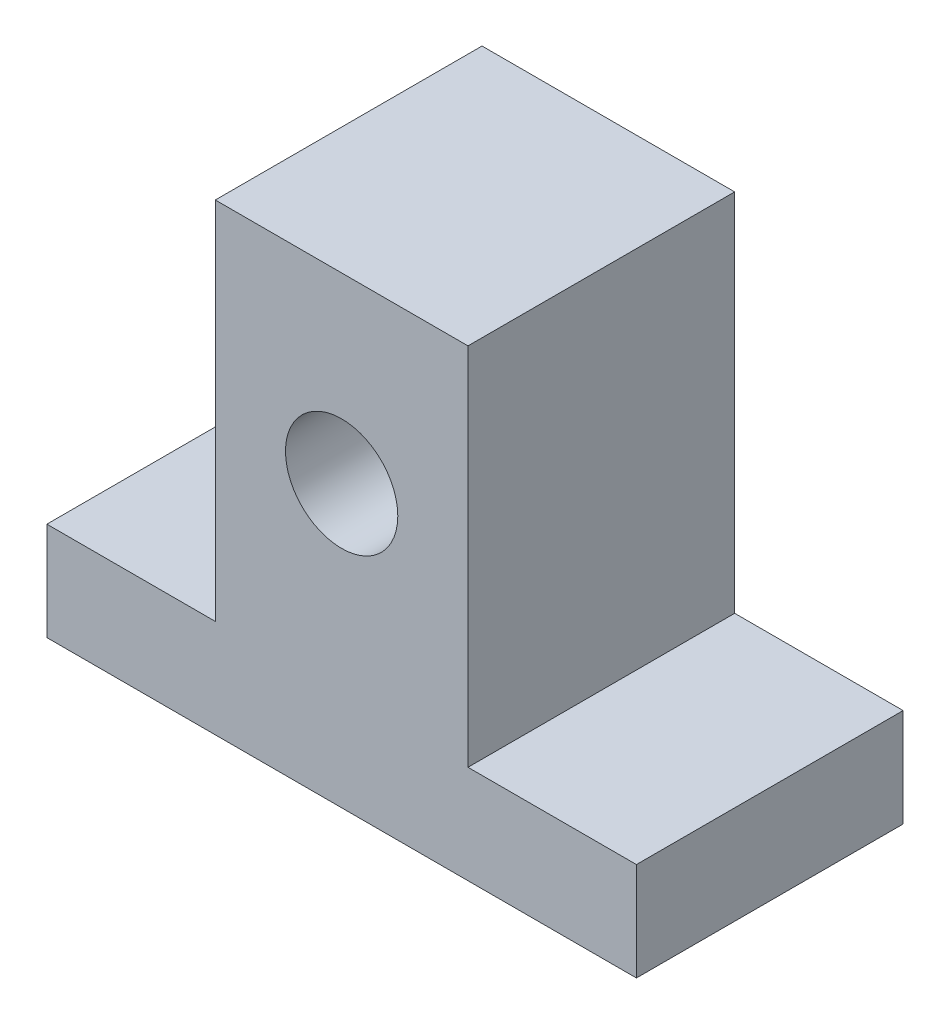
ISO-10303-21;
HEADER;
FILE_DESCRIPTION(('STEP AP214'),'2;1');
FILE_NAME('part.step','',(''),(''),'','','');
FILE_SCHEMA(('AUTOMOTIVE_DESIGN { 1 0 10303 214 1 1 1 1 }'));
ENDSEC;
DATA;
#1=APPLICATION_CONTEXT('core data for automotive mechanical design processes');
#2=APPLICATION_PROTOCOL_DEFINITION('international standard','automotive_design',2000,#1);
#3=PRODUCT_CONTEXT('',#1,'mechanical');
#4=PRODUCT('Part','Part','',(#3));
#5=PRODUCT_RELATED_PRODUCT_CATEGORY('part','',(#4));
#6=PRODUCT_DEFINITION_FORMATION('','',#4);
#7=PRODUCT_DEFINITION_CONTEXT('part definition',#1,'design');
#8=PRODUCT_DEFINITION('design','',#6,#7);
#9=PRODUCT_DEFINITION_SHAPE('','',#8);
#10=(LENGTH_UNIT() NAMED_UNIT(*) SI_UNIT(.MILLI.,.METRE.));
#11=(NAMED_UNIT(*) PLANE_ANGLE_UNIT() SI_UNIT($,.RADIAN.));
#12=(NAMED_UNIT(*) SI_UNIT($,.STERADIAN.) SOLID_ANGLE_UNIT());
#13=UNCERTAINTY_MEASURE_WITH_UNIT(LENGTH_MEASURE(1.E-05),#10,'distance_accuracy_value','');
#14=(GEOMETRIC_REPRESENTATION_CONTEXT(3) GLOBAL_UNCERTAINTY_ASSIGNED_CONTEXT((#13)) GLOBAL_UNIT_ASSIGNED_CONTEXT((#10,
#11,#12)) REPRESENTATION_CONTEXT('',''));
#15=CARTESIAN_POINT('',(0.,0.,0.));
#16=DIRECTION('',(0.,0.,1.));
#17=DIRECTION('',(1.,0.,0.));
#18=AXIS2_PLACEMENT_3D('',#15,#16,#17);
#19=CARTESIAN_POINT('',(-21.,0.,19.));
#20=DIRECTION('',(1.,0.,0.));
#21=DIRECTION('',(0.,0.,-1.));
#22=AXIS2_PLACEMENT_3D('',#19,#20,#21);
#23=PLANE('',#22);
#24=DIRECTION('',(0.,-1.,0.));
#25=VECTOR('',#24,1.);
#26=CARTESIAN_POINT('',(-21.,0.,0.));
#27=LINE('',#26,#25);
#28=CARTESIAN_POINT('',(-21.,7.,0.));
#29=VERTEX_POINT('',#28);
#30=CARTESIAN_POINT('',(-21.,0.,0.));
#31=VERTEX_POINT('',#30);
#32=EDGE_CURVE('E133',#29,#31,#27,.T.);
#33=ORIENTED_EDGE('',*,*,#32,.T.);
#34=DIRECTION('',(0.,0.,-1.));
#35=VECTOR('',#34,1.);
#36=CARTESIAN_POINT('',(-21.,0.,19.));
#37=LINE('',#36,#35);
#38=CARTESIAN_POINT('',(-21.,0.,19.));
#39=VERTEX_POINT('',#38);
#40=EDGE_CURVE('E11',#39,#31,#37,.T.);
#41=ORIENTED_EDGE('',*,*,#40,.F.);
#42=DIRECTION('',(0.,-1.,0.));
#43=VECTOR('',#42,1.);
#44=CARTESIAN_POINT('',(-21.,0.,19.));
#45=LINE('',#44,#43);
#46=CARTESIAN_POINT('',(-21.,7.,19.));
#47=VERTEX_POINT('',#46);
#48=EDGE_CURVE('E179',#47,#39,#45,.T.);
#49=ORIENTED_EDGE('',*,*,#48,.F.);
#50=DIRECTION('',(0.,0.,-1.));
#51=VECTOR('',#50,1.);
#52=CARTESIAN_POINT('',(-21.,7.,19.));
#53=LINE('',#52,#51);
#54=EDGE_CURVE('E126',#47,#29,#53,.T.);
#55=ORIENTED_EDGE('',*,*,#54,.T.);
#56=EDGE_LOOP('',(#33,#41,#49,#55));
#57=FACE_BOUND('',#56,.T.);
#58=ADVANCED_FACE('F33',(#57),#23,.F.);
#59=CARTESIAN_POINT('',(0.,0.,19.));
#60=DIRECTION('',(0.,1.,0.));
#61=DIRECTION('',(0.,0.,1.));
#62=AXIS2_PLACEMENT_3D('',#59,#60,#61);
#63=PLANE('',#62);
#64=DIRECTION('',(1.,0.,0.));
#65=VECTOR('',#64,1.);
#66=CARTESIAN_POINT('',(0.,0.,0.));
#67=LINE('',#66,#65);
#68=CARTESIAN_POINT('',(21.,0.,0.));
#69=VERTEX_POINT('',#68);
#70=EDGE_CURVE('E136',#31,#69,#67,.T.);
#71=ORIENTED_EDGE('',*,*,#70,.T.);
#72=DIRECTION('',(0.,0.,-1.));
#73=VECTOR('',#72,1.);
#74=CARTESIAN_POINT('',(21.,0.,19.));
#75=LINE('',#74,#73);
#76=CARTESIAN_POINT('',(21.,0.,19.));
#77=VERTEX_POINT('',#76);
#78=EDGE_CURVE('E42',#77,#69,#75,.T.);
#79=ORIENTED_EDGE('',*,*,#78,.F.);
#80=DIRECTION('',(1.,0.,0.));
#81=VECTOR('',#80,1.);
#82=CARTESIAN_POINT('',(0.,0.,19.));
#83=LINE('',#82,#81);
#84=EDGE_CURVE('E93',#39,#77,#83,.T.);
#85=ORIENTED_EDGE('',*,*,#84,.F.);
#86=ORIENTED_EDGE('',*,*,#40,.T.);
#87=EDGE_LOOP('',(#71,#79,#85,#86));
#88=FACE_BOUND('',#87,.T.);
#89=ADVANCED_FACE('F197',(#88),#63,.F.);
#90=CARTESIAN_POINT('',(21.,0.,19.));
#91=DIRECTION('',(-1.,0.,0.));
#92=DIRECTION('',(0.,0.,1.));
#93=AXIS2_PLACEMENT_3D('',#90,#91,#92);
#94=PLANE('',#93);
#95=DIRECTION('',(0.,1.,0.));
#96=VECTOR('',#95,1.);
#97=CARTESIAN_POINT('',(21.,0.,0.));
#98=LINE('',#97,#96);
#99=CARTESIAN_POINT('',(21.,7.,0.));
#100=VERTEX_POINT('',#99);
#101=EDGE_CURVE('E138',#69,#100,#98,.T.);
#102=ORIENTED_EDGE('',*,*,#101,.T.);
#103=DIRECTION('',(0.,0.,-1.));
#104=VECTOR('',#103,1.);
#105=CARTESIAN_POINT('',(21.,7.,19.));
#106=LINE('',#105,#104);
#107=CARTESIAN_POINT('',(21.,7.,19.));
#108=VERTEX_POINT('',#107);
#109=EDGE_CURVE('E154',#108,#100,#106,.T.);
#110=ORIENTED_EDGE('',*,*,#109,.F.);
#111=DIRECTION('',(0.,1.,0.));
#112=VECTOR('',#111,1.);
#113=CARTESIAN_POINT('',(21.,0.,19.));
#114=LINE('',#113,#112);
#115=EDGE_CURVE('E162',#77,#108,#114,.T.);
#116=ORIENTED_EDGE('',*,*,#115,.F.);
#117=ORIENTED_EDGE('',*,*,#78,.T.);
#118=EDGE_LOOP('',(#102,#110,#116,#117));
#119=FACE_BOUND('',#118,.T.);
#120=ADVANCED_FACE('F160',(#119),#94,.F.);
#121=CARTESIAN_POINT('',(0.,6.99999999999999,19.));
#122=DIRECTION('',(0.,-1.,0.));
#123=DIRECTION('',(1.,0.,0.));
#124=AXIS2_PLACEMENT_3D('',#121,#122,#123);
#125=PLANE('',#124);
#126=DIRECTION('',(-1.,0.,0.));
#127=VECTOR('',#126,1.);
#128=CARTESIAN_POINT('',(0.,6.99999999999999,0.));
#129=LINE('',#128,#127);
#130=CARTESIAN_POINT('',(9.,7.,0.));
#131=VERTEX_POINT('',#130);
#132=EDGE_CURVE('E140',#100,#131,#129,.T.);
#133=ORIENTED_EDGE('',*,*,#132,.T.);
#134=DIRECTION('',(0.,0.,-1.));
#135=VECTOR('',#134,1.);
#136=CARTESIAN_POINT('',(9.,7.,19.));
#137=LINE('',#136,#135);
#138=CARTESIAN_POINT('',(9.,7.,19.));
#139=VERTEX_POINT('',#138);
#140=EDGE_CURVE('E151',#139,#131,#137,.T.);
#141=ORIENTED_EDGE('',*,*,#140,.F.);
#142=DIRECTION('',(-1.,0.,0.));
#143=VECTOR('',#142,1.);
#144=CARTESIAN_POINT('',(0.,6.99999999999999,19.));
#145=LINE('',#144,#143);
#146=EDGE_CURVE('E174',#108,#139,#145,.T.);
#147=ORIENTED_EDGE('',*,*,#146,.F.);
#148=ORIENTED_EDGE('',*,*,#109,.T.);
#149=EDGE_LOOP('',(#133,#141,#147,#148));
#150=FACE_BOUND('',#149,.T.);
#151=ADVANCED_FACE('F170',(#150),#125,.F.);
#152=CARTESIAN_POINT('',(9.,0.,19.));
#153=DIRECTION('',(-1.,0.,0.));
#154=DIRECTION('',(0.,0.,1.));
#155=AXIS2_PLACEMENT_3D('',#152,#153,#154);
#156=PLANE('',#155);
#157=DIRECTION('',(0.,1.,0.));
#158=VECTOR('',#157,1.);
#159=CARTESIAN_POINT('',(9.,0.,0.));
#160=LINE('',#159,#158);
#161=CARTESIAN_POINT('',(9.,33.,0.));
#162=VERTEX_POINT('',#161);
#163=EDGE_CURVE('E142',#131,#162,#160,.T.);
#164=ORIENTED_EDGE('',*,*,#163,.T.);
#165=DIRECTION('',(0.,0.,-1.));
#166=VECTOR('',#165,1.);
#167=CARTESIAN_POINT('',(9.,33.,19.));
#168=LINE('',#167,#166);
#169=CARTESIAN_POINT('',(9.,33.,19.));
#170=VERTEX_POINT('',#169);
#171=EDGE_CURVE('E121',#170,#162,#168,.T.);
#172=ORIENTED_EDGE('',*,*,#171,.F.);
#173=DIRECTION('',(0.,1.,0.));
#174=VECTOR('',#173,1.);
#175=CARTESIAN_POINT('',(9.,0.,19.));
#176=LINE('',#175,#174);
#177=EDGE_CURVE('E112',#139,#170,#176,.T.);
#178=ORIENTED_EDGE('',*,*,#177,.F.);
#179=ORIENTED_EDGE('',*,*,#140,.T.);
#180=EDGE_LOOP('',(#164,#172,#178,#179));
#181=FACE_BOUND('',#180,.T.);
#182=ADVANCED_FACE('F173',(#181),#156,.F.);
#183=CARTESIAN_POINT('',(0.,33.,19.));
#184=DIRECTION('',(0.,-1.,0.));
#185=DIRECTION('',(0.,0.,-1.));
#186=AXIS2_PLACEMENT_3D('',#183,#184,#185);
#187=PLANE('',#186);
#188=DIRECTION('',(-1.,0.,0.));
#189=VECTOR('',#188,1.);
#190=CARTESIAN_POINT('',(0.,33.,0.));
#191=LINE('',#190,#189);
#192=CARTESIAN_POINT('',(-9.,33.,0.));
#193=VERTEX_POINT('',#192);
#194=EDGE_CURVE('E120',#162,#193,#191,.T.);
#195=ORIENTED_EDGE('',*,*,#194,.T.);
#196=DIRECTION('',(0.,0.,-1.));
#197=VECTOR('',#196,1.);
#198=CARTESIAN_POINT('',(-9.,33.,19.));
#199=LINE('',#198,#197);
#200=CARTESIAN_POINT('',(-9.,33.,19.));
#201=VERTEX_POINT('',#200);
#202=EDGE_CURVE('E117',#201,#193,#199,.T.);
#203=ORIENTED_EDGE('',*,*,#202,.F.);
#204=DIRECTION('',(-1.,0.,0.));
#205=VECTOR('',#204,1.);
#206=CARTESIAN_POINT('',(0.,33.,19.));
#207=LINE('',#206,#205);
#208=EDGE_CURVE('E106',#170,#201,#207,.T.);
#209=ORIENTED_EDGE('',*,*,#208,.F.);
#210=ORIENTED_EDGE('',*,*,#171,.T.);
#211=EDGE_LOOP('',(#195,#203,#209,#210));
#212=FACE_BOUND('',#211,.T.);
#213=ADVANCED_FACE('F118',(#212),#187,.F.);
#214=CARTESIAN_POINT('',(-8.99999999999999,0.,19.));
#215=DIRECTION('',(1.,0.,0.));
#216=DIRECTION('',(0.,1.,0.));
#217=AXIS2_PLACEMENT_3D('',#214,#215,#216);
#218=PLANE('',#217);
#219=DIRECTION('',(0.,-1.,0.));
#220=VECTOR('',#219,1.);
#221=CARTESIAN_POINT('',(-8.99999999999999,0.,0.));
#222=LINE('',#221,#220);
#223=CARTESIAN_POINT('',(-9.,7.,0.));
#224=VERTEX_POINT('',#223);
#225=EDGE_CURVE('E79',#193,#224,#222,.T.);
#226=ORIENTED_EDGE('',*,*,#225,.T.);
#227=DIRECTION('',(0.,0.,-1.));
#228=VECTOR('',#227,1.);
#229=CARTESIAN_POINT('',(-9.,7.,19.));
#230=LINE('',#229,#228);
#231=CARTESIAN_POINT('',(-9.,7.,19.));
#232=VERTEX_POINT('',#231);
#233=EDGE_CURVE('E122',#232,#224,#230,.T.);
#234=ORIENTED_EDGE('',*,*,#233,.F.);
#235=DIRECTION('',(0.,-1.,0.));
#236=VECTOR('',#235,1.);
#237=CARTESIAN_POINT('',(-8.99999999999999,0.,19.));
#238=LINE('',#237,#236);
#239=EDGE_CURVE('E110',#201,#232,#238,.T.);
#240=ORIENTED_EDGE('',*,*,#239,.F.);
#241=ORIENTED_EDGE('',*,*,#202,.T.);
#242=EDGE_LOOP('',(#226,#234,#240,#241));
#243=FACE_BOUND('',#242,.T.);
#244=ADVANCED_FACE('F124',(#243),#218,.F.);
#245=CARTESIAN_POINT('',(0.,20.,19.));
#246=DIRECTION('',(0.,0.,-1.));
#247=DIRECTION('',(-1.,0.,0.));
#248=AXIS2_PLACEMENT_3D('',#245,#246,#247);
#249=CYLINDRICAL_SURFACE('',#248,4.);
#250=CARTESIAN_POINT('',(0.,20.,19.));
#251=DIRECTION('',(0.,0.,1.));
#252=DIRECTION('',(1.,0.,0.));
#253=AXIS2_PLACEMENT_3D('',#250,#251,#252);
#254=CIRCLE('',#253,4.);
#255=CARTESIAN_POINT('',(4.,20.,19.));
#256=VERTEX_POINT('',#255);
#257=EDGE_CURVE('E147',#256,#256,#254,.T.);
#258=ORIENTED_EDGE('',*,*,#257,.T.);
#259=EDGE_LOOP('',(#258));
#260=FACE_BOUND('',#259,.T.);
#261=CARTESIAN_POINT('',(0.,20.,0.));
#262=DIRECTION('',(0.,0.,1.));
#263=DIRECTION('',(1.,0.,0.));
#264=AXIS2_PLACEMENT_3D('',#261,#262,#263);
#265=CIRCLE('',#264,4.);
#266=CARTESIAN_POINT('',(4.,20.,0.));
#267=VERTEX_POINT('',#266);
#268=EDGE_CURVE('E130',#267,#267,#265,.T.);
#269=ORIENTED_EDGE('',*,*,#268,.F.);
#270=EDGE_LOOP('',(#269));
#271=FACE_BOUND('',#270,.T.);
#272=ADVANCED_FACE('F35',(#260,#271),#249,.F.);
#273=CARTESIAN_POINT('',(0.,7.,19.));
#274=DIRECTION('',(0.,-1.,0.));
#275=DIRECTION('',(0.,0.,-1.));
#276=AXIS2_PLACEMENT_3D('',#273,#274,#275);
#277=PLANE('',#276);
#278=DIRECTION('',(-1.,0.,0.));
#279=VECTOR('',#278,1.);
#280=CARTESIAN_POINT('',(0.,7.,0.));
#281=LINE('',#280,#279);
#282=EDGE_CURVE('E85',#224,#29,#281,.T.);
#283=ORIENTED_EDGE('',*,*,#282,.T.);
#284=ORIENTED_EDGE('',*,*,#54,.F.);
#285=DIRECTION('',(-1.,0.,0.));
#286=VECTOR('',#285,1.);
#287=CARTESIAN_POINT('',(0.,7.,19.));
#288=LINE('',#287,#286);
#289=EDGE_CURVE('E50',#232,#47,#288,.T.);
#290=ORIENTED_EDGE('',*,*,#289,.F.);
#291=ORIENTED_EDGE('',*,*,#233,.T.);
#292=EDGE_LOOP('',(#283,#284,#290,#291));
#293=FACE_BOUND('',#292,.T.);
#294=ADVANCED_FACE('F187',(#293),#277,.F.);
#295=CARTESIAN_POINT('',(0.,0.,19.));
#296=DIRECTION('',(0.,0.,1.));
#297=DIRECTION('',(1.,0.,0.));
#298=AXIS2_PLACEMENT_3D('',#295,#296,#297);
#299=PLANE('',#298);
#300=ORIENTED_EDGE('',*,*,#257,.F.);
#301=EDGE_LOOP('',(#300));
#302=FACE_BOUND('',#301,.T.);
#303=ORIENTED_EDGE('',*,*,#48,.T.);
#304=ORIENTED_EDGE('',*,*,#84,.T.);
#305=ORIENTED_EDGE('',*,*,#115,.T.);
#306=ORIENTED_EDGE('',*,*,#146,.T.);
#307=ORIENTED_EDGE('',*,*,#177,.T.);
#308=ORIENTED_EDGE('',*,*,#208,.T.);
#309=ORIENTED_EDGE('',*,*,#239,.T.);
#310=ORIENTED_EDGE('',*,*,#289,.T.);
#311=EDGE_LOOP('',(#303,#304,#305,#306,#307,#308,#309,#310));
#312=FACE_BOUND('',#311,.T.);
#313=ADVANCED_FACE('F108',(#302,#312),#299,.T.);
#314=CARTESIAN_POINT('',(0.,0.,0.));
#315=DIRECTION('',(0.,0.,1.));
#316=DIRECTION('',(1.,0.,0.));
#317=AXIS2_PLACEMENT_3D('',#314,#315,#316);
#318=PLANE('',#317);
#319=ORIENTED_EDGE('',*,*,#268,.T.);
#320=EDGE_LOOP('',(#319));
#321=FACE_BOUND('',#320,.T.);
#322=ORIENTED_EDGE('',*,*,#32,.F.);
#323=ORIENTED_EDGE('',*,*,#282,.F.);
#324=ORIENTED_EDGE('',*,*,#225,.F.);
#325=ORIENTED_EDGE('',*,*,#194,.F.);
#326=ORIENTED_EDGE('',*,*,#163,.F.);
#327=ORIENTED_EDGE('',*,*,#132,.F.);
#328=ORIENTED_EDGE('',*,*,#101,.F.);
#329=ORIENTED_EDGE('',*,*,#70,.F.);
#330=EDGE_LOOP('',(#322,#323,#324,#325,#326,#327,#328,#329));
#331=FACE_BOUND('',#330,.T.);
#332=ADVANCED_FACE('F166',(#321,#331),#318,.F.);
#333=CLOSED_SHELL('',(#58,#89,#120,#151,#182,#213,#244,#272,#294,#313,#332));
#334=MANIFOLD_SOLID_BREP('B2',#333);
#335=ADVANCED_BREP_SHAPE_REPRESENTATION('',(#18,#334),#14);
#336=SHAPE_DEFINITION_REPRESENTATION(#9,#335);
ENDSEC;
END-ISO-10303-21;
